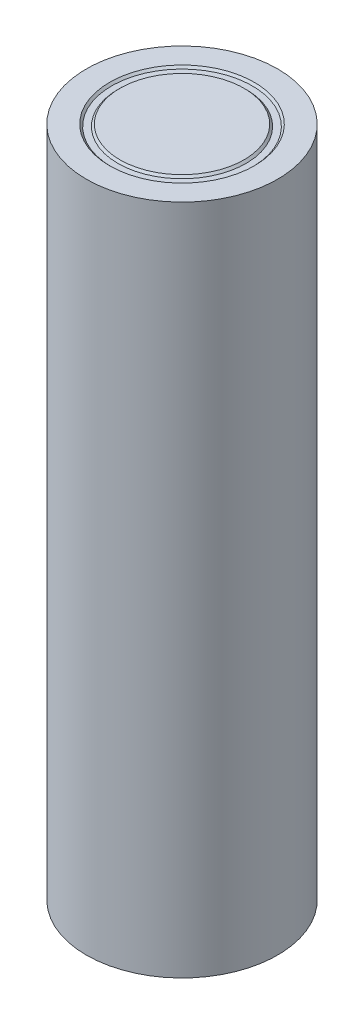
ISO-10303-21;
HEADER;
FILE_DESCRIPTION(('STEP AP214'),'2;1');
FILE_NAME('part.step','',(''),(''),'','','');
FILE_SCHEMA(('AUTOMOTIVE_DESIGN { 1 0 10303 214 1 1 1 1 }'));
ENDSEC;
DATA;
#1=APPLICATION_CONTEXT('core data for automotive mechanical design processes');
#2=APPLICATION_PROTOCOL_DEFINITION('international standard','automotive_design',2000,#1);
#3=PRODUCT_CONTEXT('',#1,'mechanical');
#4=PRODUCT('Part','Part','',(#3));
#5=PRODUCT_RELATED_PRODUCT_CATEGORY('part','',(#4));
#6=PRODUCT_DEFINITION_FORMATION('','',#4);
#7=PRODUCT_DEFINITION_CONTEXT('part definition',#1,'design');
#8=PRODUCT_DEFINITION('design','',#6,#7);
#9=PRODUCT_DEFINITION_SHAPE('','',#8);
#10=(LENGTH_UNIT() NAMED_UNIT(*) SI_UNIT(.MILLI.,.METRE.));
#11=(NAMED_UNIT(*) PLANE_ANGLE_UNIT() SI_UNIT($,.RADIAN.));
#12=(NAMED_UNIT(*) SI_UNIT($,.STERADIAN.) SOLID_ANGLE_UNIT());
#13=UNCERTAINTY_MEASURE_WITH_UNIT(LENGTH_MEASURE(1.E-05),#10,'distance_accuracy_value','');
#14=(GEOMETRIC_REPRESENTATION_CONTEXT(3) GLOBAL_UNCERTAINTY_ASSIGNED_CONTEXT((#13)) GLOBAL_UNIT_ASSIGNED_CONTEXT((#10,
#11,#12)) REPRESENTATION_CONTEXT('',''));
#15=CARTESIAN_POINT('',(0.,0.,0.));
#16=DIRECTION('',(0.,0.,1.));
#17=DIRECTION('',(1.,0.,0.));
#18=AXIS2_PLACEMENT_3D('',#15,#16,#17);
#19=CARTESIAN_POINT('',(0.,65.,0.));
#20=DIRECTION('',(0.,-1.,0.));
#21=DIRECTION('',(0.,0.,-1.));
#22=AXIS2_PLACEMENT_3D('',#19,#20,#21);
#23=CYLINDRICAL_SURFACE('',#22,9.25);
#24=CARTESIAN_POINT('',(0.,65.,0.));
#25=DIRECTION('',(0.,1.,0.));
#26=DIRECTION('',(0.,0.,1.));
#27=AXIS2_PLACEMENT_3D('',#24,#25,#26);
#28=CIRCLE('',#27,9.25);
#29=CARTESIAN_POINT('',(0.,65.,9.25));
#30=VERTEX_POINT('',#29);
#31=EDGE_CURVE('E10',#30,#30,#28,.T.);
#32=ORIENTED_EDGE('',*,*,#31,.F.);
#33=EDGE_LOOP('',(#32));
#34=FACE_BOUND('',#33,.T.);
#35=CARTESIAN_POINT('',(0.,0.,0.));
#36=DIRECTION('',(0.,1.,0.));
#37=DIRECTION('',(0.,0.,1.));
#38=AXIS2_PLACEMENT_3D('',#35,#36,#37);
#39=CIRCLE('',#38,9.25);
#40=CARTESIAN_POINT('',(0.,0.,9.25));
#41=VERTEX_POINT('',#40);
#42=EDGE_CURVE('E40',#41,#41,#39,.T.);
#43=ORIENTED_EDGE('',*,*,#42,.T.);
#44=EDGE_LOOP('',(#43));
#45=FACE_BOUND('',#44,.T.);
#46=ADVANCED_FACE('F37',(#34,#45),#23,.T.);
#47=CARTESIAN_POINT('',(0.,65.,0.));
#48=DIRECTION('',(0.,1.,0.));
#49=DIRECTION('',(0.,0.,1.));
#50=AXIS2_PLACEMENT_3D('',#47,#48,#49);
#51=PLANE('',#50);
#52=CARTESIAN_POINT('',(0.,65.,0.));
#53=DIRECTION('',(0.,1.,0.));
#54=DIRECTION('',(0.,0.,1.));
#55=AXIS2_PLACEMENT_3D('',#52,#53,#54);
#56=CIRCLE('',#55,7.);
#57=CARTESIAN_POINT('',(0.,65.,7.));
#58=VERTEX_POINT('',#57);
#59=EDGE_CURVE('E51',#58,#58,#56,.T.);
#60=ORIENTED_EDGE('',*,*,#59,.F.);
#61=EDGE_LOOP('',(#60));
#62=FACE_BOUND('',#61,.T.);
#63=ORIENTED_EDGE('',*,*,#31,.T.);
#64=EDGE_LOOP('',(#63));
#65=FACE_BOUND('',#64,.T.);
#66=ADVANCED_FACE('F73',(#62,#65),#51,.T.);
#67=CARTESIAN_POINT('',(0.,0.,0.));
#68=DIRECTION('',(0.,1.,0.));
#69=DIRECTION('',(0.,0.,1.));
#70=AXIS2_PLACEMENT_3D('',#67,#68,#69);
#71=PLANE('',#70);
#72=ORIENTED_EDGE('',*,*,#42,.F.);
#73=EDGE_LOOP('',(#72));
#74=FACE_BOUND('',#73,.T.);
#75=ADVANCED_FACE('F83',(#74),#71,.F.);
#76=CARTESIAN_POINT('',(0.,65.,0.));
#77=DIRECTION('',(0.,1.,0.));
#78=DIRECTION('',(0.,0.,1.));
#79=AXIS2_PLACEMENT_3D('',#76,#77,#78);
#80=CONICAL_SURFACE('',#79,7.,0.78539816339745);
#81=CARTESIAN_POINT('',(0.,64.8,0.));
#82=DIRECTION('',(0.,1.,0.));
#83=DIRECTION('',(0.,0.,1.));
#84=AXIS2_PLACEMENT_3D('',#81,#82,#83);
#85=CIRCLE('',#84,6.79999999999999);
#86=CARTESIAN_POINT('',(0.,64.8,6.79999999999999));
#87=VERTEX_POINT('',#86);
#88=EDGE_CURVE('E47',#87,#87,#85,.T.);
#89=ORIENTED_EDGE('',*,*,#88,.F.);
#90=EDGE_LOOP('',(#89));
#91=FACE_BOUND('',#90,.T.);
#92=ORIENTED_EDGE('',*,*,#59,.T.);
#93=EDGE_LOOP('',(#92));
#94=FACE_BOUND('',#93,.T.);
#95=ADVANCED_FACE('F74',(#91,#94),#80,.F.);
#96=CARTESIAN_POINT('',(0.,64.8,0.));
#97=DIRECTION('',(0.,1.,0.));
#98=DIRECTION('',(0.,0.,1.));
#99=AXIS2_PLACEMENT_3D('',#96,#97,#98);
#100=PLANE('',#99);
#101=CARTESIAN_POINT('',(0.,64.8,0.));
#102=DIRECTION('',(0.,1.,0.));
#103=DIRECTION('',(0.,0.,1.));
#104=AXIS2_PLACEMENT_3D('',#101,#102,#103);
#105=CIRCLE('',#104,6.20000000000001);
#106=CARTESIAN_POINT('',(0.,64.8,6.20000000000001));
#107=VERTEX_POINT('',#106);
#108=EDGE_CURVE('E52',#107,#107,#105,.T.);
#109=ORIENTED_EDGE('',*,*,#108,.F.);
#110=EDGE_LOOP('',(#109));
#111=FACE_BOUND('',#110,.T.);
#112=ORIENTED_EDGE('',*,*,#88,.T.);
#113=EDGE_LOOP('',(#112));
#114=FACE_BOUND('',#113,.T.);
#115=ADVANCED_FACE('F65',(#111,#114),#100,.T.);
#116=CARTESIAN_POINT('',(0.,65.,0.));
#117=DIRECTION('',(0.,-1.,0.));
#118=DIRECTION('',(0.,0.,1.));
#119=AXIS2_PLACEMENT_3D('',#116,#117,#118);
#120=CONICAL_SURFACE('',#119,6.,0.78539816339745);
#121=ORIENTED_EDGE('',*,*,#108,.T.);
#122=EDGE_LOOP('',(#121));
#123=FACE_BOUND('',#122,.T.);
#124=CARTESIAN_POINT('',(0.,65.,0.));
#125=DIRECTION('',(0.,1.,0.));
#126=DIRECTION('',(0.,0.,1.));
#127=AXIS2_PLACEMENT_3D('',#124,#125,#126);
#128=CIRCLE('',#127,6.);
#129=CARTESIAN_POINT('',(0.,65.,6.));
#130=VERTEX_POINT('',#129);
#131=EDGE_CURVE('E55',#130,#130,#128,.T.);
#132=ORIENTED_EDGE('',*,*,#131,.F.);
#133=EDGE_LOOP('',(#132));
#134=FACE_BOUND('',#133,.T.);
#135=ADVANCED_FACE('F63',(#123,#134),#120,.T.);
#136=ORIENTED_EDGE('',*,*,#131,.T.);
#137=EDGE_LOOP('',(#136));
#138=FACE_BOUND('',#137,.T.);
#139=ADVANCED_FACE('F61',(#138),#51,.T.);
#140=CLOSED_SHELL('',(#46,#66,#75,#95,#115,#135,#139));
#141=MANIFOLD_SOLID_BREP('B2',#140);
#142=ADVANCED_BREP_SHAPE_REPRESENTATION('',(#18,#141),#14);
#143=SHAPE_DEFINITION_REPRESENTATION(#9,#142);
ENDSEC;
END-ISO-10303-21;
